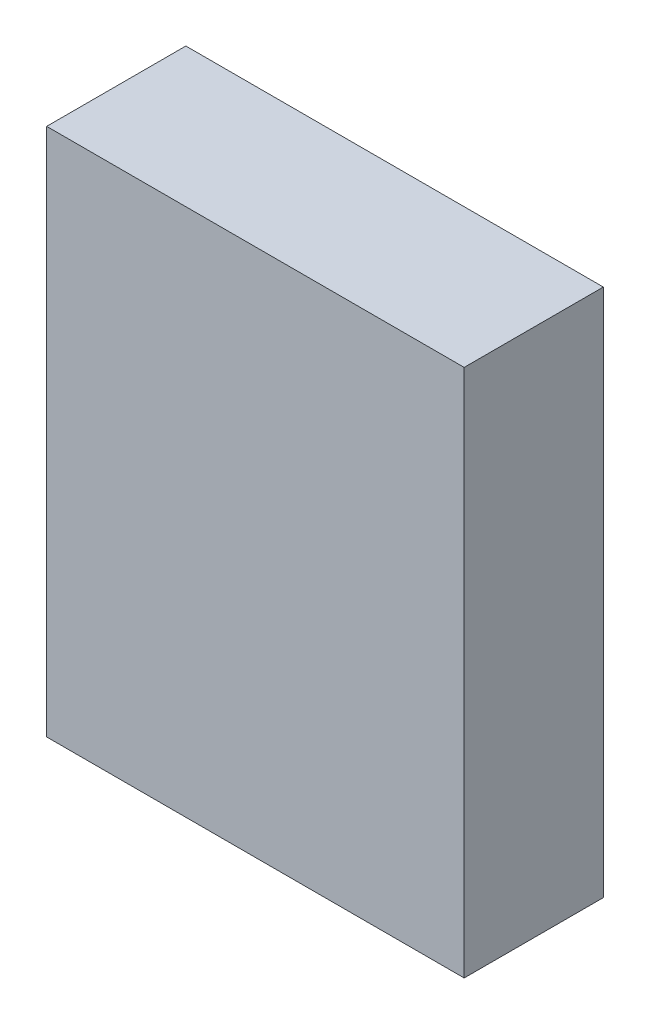
ISO-10303-21;
HEADER;
FILE_DESCRIPTION(('STEP AP214'),'2;1');
FILE_NAME('part.step','',(''),(''),'','','');
FILE_SCHEMA(('AUTOMOTIVE_DESIGN { 1 0 10303 214 1 1 1 1 }'));
ENDSEC;
DATA;
#1=APPLICATION_CONTEXT('core data for automotive mechanical design processes');
#2=APPLICATION_PROTOCOL_DEFINITION('international standard','automotive_design',2000,#1);
#3=PRODUCT_CONTEXT('',#1,'mechanical');
#4=PRODUCT('Part','Part','',(#3));
#5=PRODUCT_RELATED_PRODUCT_CATEGORY('part','',(#4));
#6=PRODUCT_DEFINITION_FORMATION('','',#4);
#7=PRODUCT_DEFINITION_CONTEXT('part definition',#1,'design');
#8=PRODUCT_DEFINITION('design','',#6,#7);
#9=PRODUCT_DEFINITION_SHAPE('','',#8);
#10=(LENGTH_UNIT() NAMED_UNIT(*) SI_UNIT(.MILLI.,.METRE.));
#11=(NAMED_UNIT(*) PLANE_ANGLE_UNIT() SI_UNIT($,.RADIAN.));
#12=(NAMED_UNIT(*) SI_UNIT($,.STERADIAN.) SOLID_ANGLE_UNIT());
#13=UNCERTAINTY_MEASURE_WITH_UNIT(LENGTH_MEASURE(1.E-05),#10,'distance_accuracy_value','');
#14=(GEOMETRIC_REPRESENTATION_CONTEXT(3) GLOBAL_UNCERTAINTY_ASSIGNED_CONTEXT((#13)) GLOBAL_UNIT_ASSIGNED_CONTEXT((#10,
#11,#12)) REPRESENTATION_CONTEXT('',''));
#15=CARTESIAN_POINT('',(0.,0.,0.));
#16=DIRECTION('',(0.,0.,1.));
#17=DIRECTION('',(1.,0.,0.));
#18=AXIS2_PLACEMENT_3D('',#15,#16,#17);
#19=CARTESIAN_POINT('',(7.5,-9.5,5.));
#20=DIRECTION('',(-1.,0.,0.));
#21=DIRECTION('',(0.,0.,1.));
#22=AXIS2_PLACEMENT_3D('',#19,#20,#21);
#23=PLANE('',#22);
#24=DIRECTION('',(0.,1.,0.));
#25=VECTOR('',#24,1.);
#26=CARTESIAN_POINT('',(7.5,-9.5,0.));
#27=LINE('',#26,#25);
#28=CARTESIAN_POINT('',(7.5,-9.5,0.));
#29=VERTEX_POINT('',#28);
#30=CARTESIAN_POINT('',(7.5,9.5,0.));
#31=VERTEX_POINT('',#30);
#32=EDGE_CURVE('E98',#29,#31,#27,.T.);
#33=ORIENTED_EDGE('',*,*,#32,.T.);
#34=DIRECTION('',(0.,0.,-1.));
#35=VECTOR('',#34,1.);
#36=CARTESIAN_POINT('',(7.5,9.5,5.));
#37=LINE('',#36,#35);
#38=CARTESIAN_POINT('',(7.5,9.5,5.));
#39=VERTEX_POINT('',#38);
#40=EDGE_CURVE('E11',#39,#31,#37,.T.);
#41=ORIENTED_EDGE('',*,*,#40,.F.);
#42=DIRECTION('',(0.,1.,0.));
#43=VECTOR('',#42,1.);
#44=CARTESIAN_POINT('',(7.5,-9.5,5.));
#45=LINE('',#44,#43);
#46=CARTESIAN_POINT('',(7.5,-9.5,5.));
#47=VERTEX_POINT('',#46);
#48=EDGE_CURVE('E86',#47,#39,#45,.T.);
#49=ORIENTED_EDGE('',*,*,#48,.F.);
#50=DIRECTION('',(0.,0.,-1.));
#51=VECTOR('',#50,1.);
#52=CARTESIAN_POINT('',(7.5,-9.5,5.));
#53=LINE('',#52,#51);
#54=EDGE_CURVE('E94',#47,#29,#53,.T.);
#55=ORIENTED_EDGE('',*,*,#54,.T.);
#56=EDGE_LOOP('',(#33,#41,#49,#55));
#57=FACE_BOUND('',#56,.T.);
#58=ADVANCED_FACE('F35',(#57),#23,.F.);
#59=CARTESIAN_POINT('',(-7.5,9.5,5.));
#60=DIRECTION('',(0.,-1.,0.));
#61=DIRECTION('',(0.,0.,-1.));
#62=AXIS2_PLACEMENT_3D('',#59,#60,#61);
#63=PLANE('',#62);
#64=DIRECTION('',(-1.,0.,0.));
#65=VECTOR('',#64,1.);
#66=CARTESIAN_POINT('',(-7.5,9.5,0.));
#67=LINE('',#66,#65);
#68=CARTESIAN_POINT('',(-7.5,9.5,0.));
#69=VERTEX_POINT('',#68);
#70=EDGE_CURVE('E90',#31,#69,#67,.T.);
#71=ORIENTED_EDGE('',*,*,#70,.T.);
#72=DIRECTION('',(0.,0.,-1.));
#73=VECTOR('',#72,1.);
#74=CARTESIAN_POINT('',(-7.5,9.5,5.));
#75=LINE('',#74,#73);
#76=CARTESIAN_POINT('',(-7.5,9.5,5.));
#77=VERTEX_POINT('',#76);
#78=EDGE_CURVE('E43',#77,#69,#75,.T.);
#79=ORIENTED_EDGE('',*,*,#78,.F.);
#80=DIRECTION('',(-1.,0.,0.));
#81=VECTOR('',#80,1.);
#82=CARTESIAN_POINT('',(-7.5,9.5,5.));
#83=LINE('',#82,#81);
#84=EDGE_CURVE('E81',#39,#77,#83,.T.);
#85=ORIENTED_EDGE('',*,*,#84,.F.);
#86=ORIENTED_EDGE('',*,*,#40,.T.);
#87=EDGE_LOOP('',(#71,#79,#85,#86));
#88=FACE_BOUND('',#87,.T.);
#89=ADVANCED_FACE('F89',(#88),#63,.F.);
#90=CARTESIAN_POINT('',(-7.5,-9.5,5.));
#91=DIRECTION('',(1.,0.,0.));
#92=DIRECTION('',(0.,0.,-1.));
#93=AXIS2_PLACEMENT_3D('',#90,#91,#92);
#94=PLANE('',#93);
#95=DIRECTION('',(0.,-1.,0.));
#96=VECTOR('',#95,1.);
#97=CARTESIAN_POINT('',(-7.5,-9.5,0.));
#98=LINE('',#97,#96);
#99=CARTESIAN_POINT('',(-7.5,-9.5,0.));
#100=VERTEX_POINT('',#99);
#101=EDGE_CURVE('E68',#69,#100,#98,.T.);
#102=ORIENTED_EDGE('',*,*,#101,.T.);
#103=DIRECTION('',(0.,0.,-1.));
#104=VECTOR('',#103,1.);
#105=CARTESIAN_POINT('',(-7.5,-9.5,5.));
#106=LINE('',#105,#104);
#107=CARTESIAN_POINT('',(-7.5,-9.5,5.));
#108=VERTEX_POINT('',#107);
#109=EDGE_CURVE('E91',#108,#100,#106,.T.);
#110=ORIENTED_EDGE('',*,*,#109,.F.);
#111=DIRECTION('',(0.,-1.,0.));
#112=VECTOR('',#111,1.);
#113=CARTESIAN_POINT('',(-7.5,-9.5,5.));
#114=LINE('',#113,#112);
#115=EDGE_CURVE('E84',#77,#108,#114,.T.);
#116=ORIENTED_EDGE('',*,*,#115,.F.);
#117=ORIENTED_EDGE('',*,*,#78,.T.);
#118=EDGE_LOOP('',(#102,#110,#116,#117));
#119=FACE_BOUND('',#118,.T.);
#120=ADVANCED_FACE('F92',(#119),#94,.F.);
#121=CARTESIAN_POINT('',(-7.5,-9.5,5.));
#122=DIRECTION('',(0.,1.,0.));
#123=DIRECTION('',(0.,0.,1.));
#124=AXIS2_PLACEMENT_3D('',#121,#122,#123);
#125=PLANE('',#124);
#126=DIRECTION('',(1.,0.,0.));
#127=VECTOR('',#126,1.);
#128=CARTESIAN_POINT('',(-7.5,-9.5,0.));
#129=LINE('',#128,#127);
#130=EDGE_CURVE('E74',#100,#29,#129,.T.);
#131=ORIENTED_EDGE('',*,*,#130,.T.);
#132=ORIENTED_EDGE('',*,*,#54,.F.);
#133=DIRECTION('',(1.,0.,0.));
#134=VECTOR('',#133,1.);
#135=CARTESIAN_POINT('',(-7.5,-9.5,5.));
#136=LINE('',#135,#134);
#137=EDGE_CURVE('E51',#108,#47,#136,.T.);
#138=ORIENTED_EDGE('',*,*,#137,.F.);
#139=ORIENTED_EDGE('',*,*,#109,.T.);
#140=EDGE_LOOP('',(#131,#132,#138,#139));
#141=FACE_BOUND('',#140,.T.);
#142=ADVANCED_FACE('F105',(#141),#125,.F.);
#143=CARTESIAN_POINT('',(0.,0.,5.));
#144=DIRECTION('',(0.,0.,-1.));
#145=DIRECTION('',(-1.,0.,0.));
#146=AXIS2_PLACEMENT_3D('',#143,#144,#145);
#147=PLANE('',#146);
#148=ORIENTED_EDGE('',*,*,#48,.T.);
#149=ORIENTED_EDGE('',*,*,#84,.T.);
#150=ORIENTED_EDGE('',*,*,#115,.T.);
#151=ORIENTED_EDGE('',*,*,#137,.T.);
#152=EDGE_LOOP('',(#148,#149,#150,#151));
#153=FACE_BOUND('',#152,.T.);
#154=ADVANCED_FACE('F82',(#153),#147,.F.);
#155=CARTESIAN_POINT('',(0.,0.,0.));
#156=DIRECTION('',(0.,0.,-1.));
#157=DIRECTION('',(-1.,0.,0.));
#158=AXIS2_PLACEMENT_3D('',#155,#156,#157);
#159=PLANE('',#158);
#160=ORIENTED_EDGE('',*,*,#32,.F.);
#161=ORIENTED_EDGE('',*,*,#130,.F.);
#162=ORIENTED_EDGE('',*,*,#101,.F.);
#163=ORIENTED_EDGE('',*,*,#70,.F.);
#164=EDGE_LOOP('',(#160,#161,#162,#163));
#165=FACE_BOUND('',#164,.T.);
#166=ADVANCED_FACE('F108',(#165),#159,.T.);
#167=CLOSED_SHELL('',(#58,#89,#120,#142,#154,#166));
#168=MANIFOLD_SOLID_BREP('B2',#167);
#169=ADVANCED_BREP_SHAPE_REPRESENTATION('',(#18,#168),#14);
#170=SHAPE_DEFINITION_REPRESENTATION(#9,#169);
ENDSEC;
END-ISO-10303-21;
